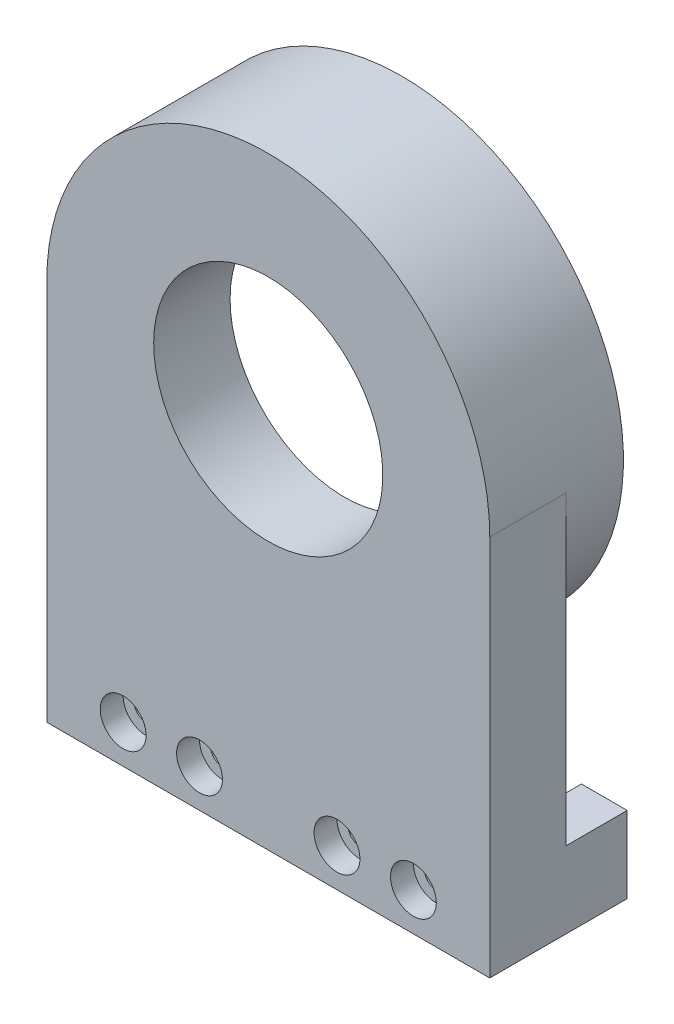
ISO-10303-21;
HEADER;
FILE_DESCRIPTION(('STEP AP214'),'2;1');
FILE_NAME('part.step','',(''),(''),'','','');
FILE_SCHEMA(('AUTOMOTIVE_DESIGN { 1 0 10303 214 1 1 1 1 }'));
ENDSEC;
DATA;
#1=APPLICATION_CONTEXT('core data for automotive mechanical design processes');
#2=APPLICATION_PROTOCOL_DEFINITION('international standard','automotive_design',2000,#1);
#3=PRODUCT_CONTEXT('',#1,'mechanical');
#4=PRODUCT('Part','Part','',(#3));
#5=PRODUCT_RELATED_PRODUCT_CATEGORY('part','',(#4));
#6=PRODUCT_DEFINITION_FORMATION('','',#4);
#7=PRODUCT_DEFINITION_CONTEXT('part definition',#1,'design');
#8=PRODUCT_DEFINITION('design','',#6,#7);
#9=PRODUCT_DEFINITION_SHAPE('','',#8);
#10=(LENGTH_UNIT() NAMED_UNIT(*) SI_UNIT(.MILLI.,.METRE.));
#11=(NAMED_UNIT(*) PLANE_ANGLE_UNIT() SI_UNIT($,.RADIAN.));
#12=(NAMED_UNIT(*) SI_UNIT($,.STERADIAN.) SOLID_ANGLE_UNIT());
#13=UNCERTAINTY_MEASURE_WITH_UNIT(LENGTH_MEASURE(1.E-05),#10,'distance_accuracy_value','');
#14=(GEOMETRIC_REPRESENTATION_CONTEXT(3) GLOBAL_UNCERTAINTY_ASSIGNED_CONTEXT((#13)) GLOBAL_UNIT_ASSIGNED_CONTEXT((#10,
#11,#12)) REPRESENTATION_CONTEXT('',''));
#15=CARTESIAN_POINT('',(0.,0.,0.));
#16=DIRECTION('',(0.,0.,1.));
#17=DIRECTION('',(1.,0.,0.));
#18=AXIS2_PLACEMENT_3D('',#15,#16,#17);
#19=CARTESIAN_POINT('',(-19.,-20.,10.001));
#20=DIRECTION('',(0.,0.,-1.));
#21=DIRECTION('',(-1.,0.,0.));
#22=AXIS2_PLACEMENT_3D('',#19,#20,#21);
#23=CYLINDRICAL_SURFACE('',#22,1.55);
#24=CARTESIAN_POINT('',(-19.,-20.,0.));
#25=DIRECTION('',(0.,0.,-1.));
#26=DIRECTION('',(1.,0.,0.));
#27=AXIS2_PLACEMENT_3D('',#24,#25,#26);
#28=CIRCLE('',#27,1.55);
#29=CARTESIAN_POINT('',(-17.45,-20.,0.));
#30=VERTEX_POINT('',#29);
#31=EDGE_CURVE('E224',#30,#30,#28,.T.);
#32=ORIENTED_EDGE('',*,*,#31,.T.);
#33=EDGE_LOOP('',(#32));
#34=FACE_BOUND('',#33,.T.);
#35=CARTESIAN_POINT('',(-19.,-20.,7.));
#36=DIRECTION('',(0.,0.,1.));
#37=DIRECTION('',(1.,0.,0.));
#38=AXIS2_PLACEMENT_3D('',#35,#36,#37);
#39=CIRCLE('',#38,1.55);
#40=CARTESIAN_POINT('',(-17.45,-20.,7.));
#41=VERTEX_POINT('',#40);
#42=EDGE_CURVE('E47',#41,#41,#39,.F.);
#43=ORIENTED_EDGE('',*,*,#42,.F.);
#44=EDGE_LOOP('',(#43));
#45=FACE_BOUND('',#44,.T.);
#46=ADVANCED_FACE('F43',(#34,#45),#23,.F.);
#47=CARTESIAN_POINT('',(-9.,-20.,10.001));
#48=DIRECTION('',(0.,0.,-1.));
#49=DIRECTION('',(-1.,0.,0.));
#50=AXIS2_PLACEMENT_3D('',#47,#48,#49);
#51=CYLINDRICAL_SURFACE('',#50,1.55);
#52=CARTESIAN_POINT('',(-9.,-20.,0.));
#53=DIRECTION('',(0.,0.,-1.));
#54=DIRECTION('',(1.,0.,0.));
#55=AXIS2_PLACEMENT_3D('',#52,#53,#54);
#56=CIRCLE('',#55,1.55);
#57=CARTESIAN_POINT('',(-7.45,-20.,0.));
#58=VERTEX_POINT('',#57);
#59=EDGE_CURVE('E228',#58,#58,#56,.T.);
#60=ORIENTED_EDGE('',*,*,#59,.T.);
#61=EDGE_LOOP('',(#60));
#62=FACE_BOUND('',#61,.T.);
#63=CARTESIAN_POINT('',(-9.,-20.,7.));
#64=DIRECTION('',(0.,0.,1.));
#65=DIRECTION('',(1.,0.,0.));
#66=AXIS2_PLACEMENT_3D('',#63,#64,#65);
#67=CIRCLE('',#66,1.55);
#68=CARTESIAN_POINT('',(-7.45,-20.,7.));
#69=VERTEX_POINT('',#68);
#70=EDGE_CURVE('E219',#69,#69,#67,.F.);
#71=ORIENTED_EDGE('',*,*,#70,.F.);
#72=EDGE_LOOP('',(#71));
#73=FACE_BOUND('',#72,.T.);
#74=ADVANCED_FACE('F292',(#62,#73),#51,.F.);
#75=CARTESIAN_POINT('',(9.,-20.,10.001));
#76=DIRECTION('',(0.,0.,-1.));
#77=DIRECTION('',(-1.,0.,0.));
#78=AXIS2_PLACEMENT_3D('',#75,#76,#77);
#79=CYLINDRICAL_SURFACE('',#78,1.55);
#80=CARTESIAN_POINT('',(9.,-20.,0.));
#81=DIRECTION('',(0.,0.,-1.));
#82=DIRECTION('',(-1.,0.,0.));
#83=AXIS2_PLACEMENT_3D('',#80,#81,#82);
#84=CIRCLE('',#83,1.55);
#85=CARTESIAN_POINT('',(7.45,-20.,0.));
#86=VERTEX_POINT('',#85);
#87=EDGE_CURVE('E233',#86,#86,#84,.T.);
#88=ORIENTED_EDGE('',*,*,#87,.T.);
#89=EDGE_LOOP('',(#88));
#90=FACE_BOUND('',#89,.T.);
#91=CARTESIAN_POINT('',(9.,-20.,7.));
#92=DIRECTION('',(0.,0.,1.));
#93=DIRECTION('',(1.,0.,0.));
#94=AXIS2_PLACEMENT_3D('',#91,#92,#93);
#95=CIRCLE('',#94,1.55);
#96=CARTESIAN_POINT('',(10.55,-20.,7.));
#97=VERTEX_POINT('',#96);
#98=EDGE_CURVE('E216',#97,#97,#95,.F.);
#99=ORIENTED_EDGE('',*,*,#98,.F.);
#100=EDGE_LOOP('',(#99));
#101=FACE_BOUND('',#100,.T.);
#102=ADVANCED_FACE('F297',(#90,#101),#79,.F.);
#103=CARTESIAN_POINT('',(19.,-20.,10.001));
#104=DIRECTION('',(0.,0.,-1.));
#105=DIRECTION('',(-1.,0.,0.));
#106=AXIS2_PLACEMENT_3D('',#103,#104,#105);
#107=CYLINDRICAL_SURFACE('',#106,1.55);
#108=CARTESIAN_POINT('',(19.,-20.,0.));
#109=DIRECTION('',(0.,0.,-1.));
#110=DIRECTION('',(-1.,0.,0.));
#111=AXIS2_PLACEMENT_3D('',#108,#109,#110);
#112=CIRCLE('',#111,1.55);
#113=CARTESIAN_POINT('',(17.45,-20.,0.));
#114=VERTEX_POINT('',#113);
#115=EDGE_CURVE('E241',#114,#114,#112,.T.);
#116=ORIENTED_EDGE('',*,*,#115,.T.);
#117=EDGE_LOOP('',(#116));
#118=FACE_BOUND('',#117,.T.);
#119=CARTESIAN_POINT('',(19.,-20.,7.));
#120=DIRECTION('',(0.,0.,1.));
#121=DIRECTION('',(1.,0.,0.));
#122=AXIS2_PLACEMENT_3D('',#119,#120,#121);
#123=CIRCLE('',#122,1.55);
#124=CARTESIAN_POINT('',(20.55,-20.,7.));
#125=VERTEX_POINT('',#124);
#126=EDGE_CURVE('E213',#125,#125,#123,.F.);
#127=ORIENTED_EDGE('',*,*,#126,.F.);
#128=EDGE_LOOP('',(#127));
#129=FACE_BOUND('',#128,.T.);
#130=ADVANCED_FACE('F336',(#118,#129),#107,.F.);
#131=CARTESIAN_POINT('',(0.,0.,0.));
#132=DIRECTION('',(0.,0.,1.));
#133=DIRECTION('',(1.,0.,0.));
#134=AXIS2_PLACEMENT_3D('',#131,#132,#133);
#135=PLANE('',#134);
#136=ORIENTED_EDGE('',*,*,#115,.F.);
#137=EDGE_LOOP('',(#136));
#138=FACE_BOUND('',#137,.T.);
#139=ORIENTED_EDGE('',*,*,#87,.F.);
#140=EDGE_LOOP('',(#139));
#141=FACE_BOUND('',#140,.T.);
#142=ORIENTED_EDGE('',*,*,#59,.F.);
#143=EDGE_LOOP('',(#142));
#144=FACE_BOUND('',#143,.T.);
#145=ORIENTED_EDGE('',*,*,#31,.F.);
#146=EDGE_LOOP('',(#145));
#147=FACE_BOUND('',#146,.T.);
#148=DIRECTION('',(1.,0.,0.));
#149=VECTOR('',#148,1.);
#150=CARTESIAN_POINT('',(0.,-15.,0.));
#151=LINE('',#150,#149);
#152=CARTESIAN_POINT('',(-29.,-15.,0.));
#153=VERTEX_POINT('',#152);
#154=CARTESIAN_POINT('',(-23.,-15.,0.));
#155=VERTEX_POINT('',#154);
#156=EDGE_CURVE('E239',#153,#155,#151,.T.);
#157=ORIENTED_EDGE('',*,*,#156,.F.);
#158=DIRECTION('',(0.,-1.,0.));
#159=VECTOR('',#158,1.);
#160=CARTESIAN_POINT('',(-29.,0.,0.));
#161=LINE('',#160,#159);
#162=CARTESIAN_POINT('',(-29.,25.,0.));
#163=VERTEX_POINT('',#162);
#164=EDGE_CURVE('E148',#163,#153,#161,.T.);
#165=ORIENTED_EDGE('',*,*,#164,.F.);
#166=CARTESIAN_POINT('',(0.,25.,0.));
#167=DIRECTION('',(0.,0.,-1.));
#168=DIRECTION('',(-1.,0.,0.));
#169=AXIS2_PLACEMENT_3D('',#166,#167,#168);
#170=CIRCLE('',#169,29.);
#171=CARTESIAN_POINT('',(29.,25.,0.));
#172=VERTEX_POINT('',#171);
#173=EDGE_CURVE('E52',#172,#163,#170,.T.);
#174=ORIENTED_EDGE('',*,*,#173,.F.);
#175=DIRECTION('',(0.,-1.,0.));
#176=VECTOR('',#175,1.);
#177=CARTESIAN_POINT('',(29.,0.,0.));
#178=LINE('',#177,#176);
#179=CARTESIAN_POINT('',(29.,-15.,0.));
#180=VERTEX_POINT('',#179);
#181=EDGE_CURVE('E193',#172,#180,#178,.T.);
#182=ORIENTED_EDGE('',*,*,#181,.T.);
#183=DIRECTION('',(-1.,0.,0.));
#184=VECTOR('',#183,1.);
#185=CARTESIAN_POINT('',(0.,-15.,0.));
#186=LINE('',#185,#184);
#187=CARTESIAN_POINT('',(23.,-15.,0.));
#188=VERTEX_POINT('',#187);
#189=EDGE_CURVE('E150',#180,#188,#186,.T.);
#190=ORIENTED_EDGE('',*,*,#189,.T.);
#191=DIRECTION('',(0.,1.,0.));
#192=VECTOR('',#191,1.);
#193=CARTESIAN_POINT('',(23.,0.,0.));
#194=LINE('',#193,#192);
#195=CARTESIAN_POINT('',(23.,-25.,0.));
#196=VERTEX_POINT('',#195);
#197=EDGE_CURVE('E68',#196,#188,#194,.T.);
#198=ORIENTED_EDGE('',*,*,#197,.F.);
#199=DIRECTION('',(1.,0.,0.));
#200=VECTOR('',#199,1.);
#201=CARTESIAN_POINT('',(0.,-25.,0.));
#202=LINE('',#201,#200);
#203=CARTESIAN_POINT('',(-23.,-25.,0.));
#204=VERTEX_POINT('',#203);
#205=EDGE_CURVE('E202',#204,#196,#202,.T.);
#206=ORIENTED_EDGE('',*,*,#205,.F.);
#207=DIRECTION('',(0.,1.,0.));
#208=VECTOR('',#207,1.);
#209=CARTESIAN_POINT('',(-23.,0.,0.));
#210=LINE('',#209,#208);
#211=EDGE_CURVE('E60',#204,#155,#210,.T.);
#212=ORIENTED_EDGE('',*,*,#211,.T.);
#213=EDGE_LOOP('',(#157,#165,#174,#182,#190,#198,#206,#212));
#214=FACE_BOUND('',#213,.T.);
#215=ADVANCED_FACE('F247',(#138,#141,#144,#147,#214),#135,.F.);
#216=CARTESIAN_POINT('',(0.,25.,10.));
#217=DIRECTION('',(0.,0.,-1.));
#218=DIRECTION('',(-1.,0.,0.));
#219=AXIS2_PLACEMENT_3D('',#216,#217,#218);
#220=CYLINDRICAL_SURFACE('',#219,29.);
#221=DIRECTION('',(0.,0.,-1.));
#222=VECTOR('',#221,1.);
#223=CARTESIAN_POINT('',(29.,25.,10.));
#224=LINE('',#223,#222);
#225=CARTESIAN_POINT('',(29.,25.,10.));
#226=VERTEX_POINT('',#225);
#227=EDGE_CURVE('E200',#226,#172,#224,.T.);
#228=ORIENTED_EDGE('',*,*,#227,.T.);
#229=ORIENTED_EDGE('',*,*,#173,.T.);
#230=DIRECTION('',(0.,0.,-1.));
#231=VECTOR('',#230,1.);
#232=CARTESIAN_POINT('',(-29.,25.,10.));
#233=LINE('',#232,#231);
#234=CARTESIAN_POINT('',(-29.,25.,10.));
#235=VERTEX_POINT('',#234);
#236=EDGE_CURVE('E188',#235,#163,#233,.T.);
#237=ORIENTED_EDGE('',*,*,#236,.F.);
#238=CARTESIAN_POINT('',(0.,25.,10.));
#239=DIRECTION('',(0.,0.,1.));
#240=DIRECTION('',(1.,0.,0.));
#241=AXIS2_PLACEMENT_3D('',#238,#239,#240);
#242=CIRCLE('',#241,29.);
#243=EDGE_CURVE('E189',#235,#226,#242,.F.);
#244=ORIENTED_EDGE('',*,*,#243,.T.);
#245=EDGE_LOOP('',(#228,#229,#237,#244));
#246=FACE_BOUND('',#245,.T.);
#247=CARTESIAN_POINT('',(0.,25.,-7.5));
#248=DIRECTION('',(0.,0.,-1.));
#249=DIRECTION('',(-1.,0.,0.));
#250=AXIS2_PLACEMENT_3D('',#247,#248,#249);
#251=CIRCLE('',#250,29.);
#252=CARTESIAN_POINT('',(-29.,25.,-7.5));
#253=VERTEX_POINT('',#252);
#254=EDGE_CURVE('E183',#253,#253,#251,.T.);
#255=ORIENTED_EDGE('',*,*,#254,.F.);
#256=EDGE_LOOP('',(#255));
#257=FACE_BOUND('',#256,.T.);
#258=ADVANCED_FACE('F45',(#246,#257),#220,.T.);
#259=CARTESIAN_POINT('',(-29.,0.,10.));
#260=DIRECTION('',(1.,0.,0.));
#261=DIRECTION('',(0.,1.,0.));
#262=AXIS2_PLACEMENT_3D('',#259,#260,#261);
#263=PLANE('',#262);
#264=ORIENTED_EDGE('',*,*,#164,.T.);
#265=DIRECTION('',(0.,0.,1.));
#266=VECTOR('',#265,1.);
#267=CARTESIAN_POINT('',(-29.,-15.,-8.));
#268=LINE('',#267,#266);
#269=CARTESIAN_POINT('',(-29.,-15.,-8.));
#270=VERTEX_POINT('',#269);
#271=EDGE_CURVE('E128',#270,#153,#268,.T.);
#272=ORIENTED_EDGE('',*,*,#271,.F.);
#273=DIRECTION('',(0.,1.,0.));
#274=VECTOR('',#273,1.);
#275=CARTESIAN_POINT('',(-29.,0.,-8.));
#276=LINE('',#275,#274);
#277=CARTESIAN_POINT('',(-29.,-25.,-8.));
#278=VERTEX_POINT('',#277);
#279=EDGE_CURVE('E135',#278,#270,#276,.T.);
#280=ORIENTED_EDGE('',*,*,#279,.F.);
#281=DIRECTION('',(0.,0.,-1.));
#282=VECTOR('',#281,1.);
#283=CARTESIAN_POINT('',(-29.,-25.,10.));
#284=LINE('',#283,#282);
#285=CARTESIAN_POINT('',(-29.,-25.,10.));
#286=VERTEX_POINT('',#285);
#287=EDGE_CURVE('E210',#286,#278,#284,.T.);
#288=ORIENTED_EDGE('',*,*,#287,.F.);
#289=DIRECTION('',(0.,-1.,0.));
#290=VECTOR('',#289,1.);
#291=CARTESIAN_POINT('',(-29.,0.,10.));
#292=LINE('',#291,#290);
#293=EDGE_CURVE('E192',#235,#286,#292,.T.);
#294=ORIENTED_EDGE('',*,*,#293,.F.);
#295=ORIENTED_EDGE('',*,*,#236,.T.);
#296=EDGE_LOOP('',(#264,#272,#280,#288,#294,#295));
#297=FACE_BOUND('',#296,.T.);
#298=ADVANCED_FACE('F146',(#297),#263,.F.);
#299=CARTESIAN_POINT('',(0.,-25.,10.));
#300=DIRECTION('',(0.,1.,0.));
#301=DIRECTION('',(0.,0.,1.));
#302=AXIS2_PLACEMENT_3D('',#299,#300,#301);
#303=PLANE('',#302);
#304=ORIENTED_EDGE('',*,*,#287,.T.);
#305=DIRECTION('',(-1.,0.,0.));
#306=VECTOR('',#305,1.);
#307=CARTESIAN_POINT('',(0.,-25.,-8.));
#308=LINE('',#307,#306);
#309=CARTESIAN_POINT('',(-23.,-25.,-8.));
#310=VERTEX_POINT('',#309);
#311=EDGE_CURVE('E141',#310,#278,#308,.T.);
#312=ORIENTED_EDGE('',*,*,#311,.F.);
#313=DIRECTION('',(0.,0.,1.));
#314=VECTOR('',#313,1.);
#315=CARTESIAN_POINT('',(-23.,-25.,-8.));
#316=LINE('',#315,#314);
#317=EDGE_CURVE('E152',#310,#204,#316,.T.);
#318=ORIENTED_EDGE('',*,*,#317,.T.);
#319=ORIENTED_EDGE('',*,*,#205,.T.);
#320=DIRECTION('',(0.,0.,1.));
#321=VECTOR('',#320,1.);
#322=CARTESIAN_POINT('',(23.,-25.,-8.));
#323=LINE('',#322,#321);
#324=CARTESIAN_POINT('',(23.,-25.,-8.));
#325=VERTEX_POINT('',#324);
#326=EDGE_CURVE('E172',#325,#196,#323,.T.);
#327=ORIENTED_EDGE('',*,*,#326,.F.);
#328=DIRECTION('',(-1.,0.,0.));
#329=VECTOR('',#328,1.);
#330=CARTESIAN_POINT('',(0.,-25.,-8.));
#331=LINE('',#330,#329);
#332=CARTESIAN_POINT('',(29.,-25.,-8.));
#333=VERTEX_POINT('',#332);
#334=EDGE_CURVE('E159',#333,#325,#331,.T.);
#335=ORIENTED_EDGE('',*,*,#334,.F.);
#336=DIRECTION('',(0.,0.,-1.));
#337=VECTOR('',#336,1.);
#338=CARTESIAN_POINT('',(29.,-25.,10.));
#339=LINE('',#338,#337);
#340=CARTESIAN_POINT('',(29.,-25.,10.));
#341=VERTEX_POINT('',#340);
#342=EDGE_CURVE('E208',#341,#333,#339,.T.);
#343=ORIENTED_EDGE('',*,*,#342,.F.);
#344=DIRECTION('',(1.,0.,0.));
#345=VECTOR('',#344,1.);
#346=CARTESIAN_POINT('',(0.,-25.,10.));
#347=LINE('',#346,#345);
#348=EDGE_CURVE('E195',#286,#341,#347,.T.);
#349=ORIENTED_EDGE('',*,*,#348,.F.);
#350=EDGE_LOOP('',(#304,#312,#318,#319,#327,#335,#343,#349));
#351=FACE_BOUND('',#350,.T.);
#352=ADVANCED_FACE('F244',(#351),#303,.F.);
#353=CARTESIAN_POINT('',(29.,0.,10.));
#354=DIRECTION('',(1.,0.,0.));
#355=DIRECTION('',(0.,0.,-1.));
#356=AXIS2_PLACEMENT_3D('',#353,#354,#355);
#357=PLANE('',#356);
#358=ORIENTED_EDGE('',*,*,#181,.F.);
#359=ORIENTED_EDGE('',*,*,#227,.F.);
#360=DIRECTION('',(0.,-1.,0.));
#361=VECTOR('',#360,1.);
#362=CARTESIAN_POINT('',(29.,0.,10.));
#363=LINE('',#362,#361);
#364=EDGE_CURVE('E197',#226,#341,#363,.T.);
#365=ORIENTED_EDGE('',*,*,#364,.T.);
#366=ORIENTED_EDGE('',*,*,#342,.T.);
#367=DIRECTION('',(0.,-1.,0.));
#368=VECTOR('',#367,1.);
#369=CARTESIAN_POINT('',(29.,0.,-8.));
#370=LINE('',#369,#368);
#371=CARTESIAN_POINT('',(29.,-15.,-8.));
#372=VERTEX_POINT('',#371);
#373=EDGE_CURVE('E156',#372,#333,#370,.T.);
#374=ORIENTED_EDGE('',*,*,#373,.F.);
#375=DIRECTION('',(0.,0.,1.));
#376=VECTOR('',#375,1.);
#377=CARTESIAN_POINT('',(29.,-15.,-8.));
#378=LINE('',#377,#376);
#379=EDGE_CURVE('E165',#372,#180,#378,.T.);
#380=ORIENTED_EDGE('',*,*,#379,.T.);
#381=EDGE_LOOP('',(#358,#359,#365,#366,#374,#380));
#382=FACE_BOUND('',#381,.T.);
#383=ADVANCED_FACE('F263',(#382),#357,.T.);
#384=CARTESIAN_POINT('',(0.,0.,10.));
#385=DIRECTION('',(0.,0.,1.));
#386=DIRECTION('',(1.,0.,0.));
#387=AXIS2_PLACEMENT_3D('',#384,#385,#386);
#388=PLANE('',#387);
#389=CARTESIAN_POINT('',(0.,25.,10.));
#390=DIRECTION('',(0.,0.,-1.));
#391=DIRECTION('',(-1.,0.,0.));
#392=AXIS2_PLACEMENT_3D('',#389,#390,#391);
#393=CIRCLE('',#392,15.);
#394=CARTESIAN_POINT('',(-15.,25.,10.));
#395=VERTEX_POINT('',#394);
#396=EDGE_CURVE('E359',#395,#395,#393,.T.);
#397=ORIENTED_EDGE('',*,*,#396,.T.);
#398=EDGE_LOOP('',(#397));
#399=FACE_BOUND('',#398,.T.);
#400=CARTESIAN_POINT('',(19.,-20.,10.));
#401=DIRECTION('',(0.,0.,1.));
#402=DIRECTION('',(1.,0.,0.));
#403=AXIS2_PLACEMENT_3D('',#400,#401,#402);
#404=CIRCLE('',#403,3.);
#405=CARTESIAN_POINT('',(22.,-20.,10.));
#406=VERTEX_POINT('',#405);
#407=EDGE_CURVE('E374',#406,#406,#404,.T.);
#408=ORIENTED_EDGE('',*,*,#407,.F.);
#409=EDGE_LOOP('',(#408));
#410=FACE_BOUND('',#409,.T.);
#411=CARTESIAN_POINT('',(9.,-20.,10.));
#412=DIRECTION('',(0.,0.,1.));
#413=DIRECTION('',(1.,0.,0.));
#414=AXIS2_PLACEMENT_3D('',#411,#412,#413);
#415=CIRCLE('',#414,3.);
#416=CARTESIAN_POINT('',(12.,-20.,10.));
#417=VERTEX_POINT('',#416);
#418=EDGE_CURVE('E371',#417,#417,#415,.T.);
#419=ORIENTED_EDGE('',*,*,#418,.F.);
#420=EDGE_LOOP('',(#419));
#421=FACE_BOUND('',#420,.T.);
#422=CARTESIAN_POINT('',(-9.,-20.,10.));
#423=DIRECTION('',(0.,0.,1.));
#424=DIRECTION('',(1.,0.,0.));
#425=AXIS2_PLACEMENT_3D('',#422,#423,#424);
#426=CIRCLE('',#425,3.);
#427=CARTESIAN_POINT('',(-6.,-20.,10.));
#428=VERTEX_POINT('',#427);
#429=EDGE_CURVE('E365',#428,#428,#426,.T.);
#430=ORIENTED_EDGE('',*,*,#429,.F.);
#431=EDGE_LOOP('',(#430));
#432=FACE_BOUND('',#431,.T.);
#433=CARTESIAN_POINT('',(-19.,-20.,10.));
#434=DIRECTION('',(0.,0.,1.));
#435=DIRECTION('',(1.,0.,0.));
#436=AXIS2_PLACEMENT_3D('',#433,#434,#435);
#437=CIRCLE('',#436,3.);
#438=CARTESIAN_POINT('',(-16.,-20.,10.));
#439=VERTEX_POINT('',#438);
#440=EDGE_CURVE('E358',#439,#439,#437,.T.);
#441=ORIENTED_EDGE('',*,*,#440,.F.);
#442=EDGE_LOOP('',(#441));
#443=FACE_BOUND('',#442,.T.);
#444=ORIENTED_EDGE('',*,*,#243,.F.);
#445=ORIENTED_EDGE('',*,*,#293,.T.);
#446=ORIENTED_EDGE('',*,*,#348,.T.);
#447=ORIENTED_EDGE('',*,*,#364,.F.);
#448=EDGE_LOOP('',(#444,#445,#446,#447));
#449=FACE_BOUND('',#448,.T.);
#450=ADVANCED_FACE('F266',(#399,#410,#421,#432,#443,#449),#388,.T.);
#451=CARTESIAN_POINT('',(0.,25.,-7.5));
#452=DIRECTION('',(0.,0.,-1.));
#453=DIRECTION('',(-1.,0.,0.));
#454=AXIS2_PLACEMENT_3D('',#451,#452,#453);
#455=PLANE('',#454);
#456=ORIENTED_EDGE('',*,*,#254,.T.);
#457=EDGE_LOOP('',(#456));
#458=FACE_BOUND('',#457,.T.);
#459=CARTESIAN_POINT('',(0.,25.,-7.5));
#460=DIRECTION('',(0.,0.,-1.));
#461=DIRECTION('',(-1.,0.,0.));
#462=AXIS2_PLACEMENT_3D('',#459,#460,#461);
#463=CIRCLE('',#462,26.1);
#464=CARTESIAN_POINT('',(-26.1,25.,-7.5));
#465=VERTEX_POINT('',#464);
#466=EDGE_CURVE('E178',#465,#465,#463,.T.);
#467=ORIENTED_EDGE('',*,*,#466,.F.);
#468=EDGE_LOOP('',(#467));
#469=FACE_BOUND('',#468,.T.);
#470=ADVANCED_FACE('F273',(#458,#469),#455,.T.);
#471=CARTESIAN_POINT('',(0.,25.,-7.5));
#472=DIRECTION('',(0.,0.,1.));
#473=DIRECTION('',(1.,0.,0.));
#474=AXIS2_PLACEMENT_3D('',#471,#472,#473);
#475=CYLINDRICAL_SURFACE('',#474,26.1);
#476=CARTESIAN_POINT('',(0.,25.,-0.5));
#477=DIRECTION('',(0.,0.,-1.));
#478=DIRECTION('',(-1.,0.,0.));
#479=AXIS2_PLACEMENT_3D('',#476,#477,#478);
#480=CIRCLE('',#479,26.1);
#481=CARTESIAN_POINT('',(-26.1,25.,-0.5));
#482=VERTEX_POINT('',#481);
#483=EDGE_CURVE('E12',#482,#482,#480,.T.);
#484=ORIENTED_EDGE('',*,*,#483,.F.);
#485=EDGE_LOOP('',(#484));
#486=FACE_BOUND('',#485,.T.);
#487=ORIENTED_EDGE('',*,*,#466,.T.);
#488=EDGE_LOOP('',(#487));
#489=FACE_BOUND('',#488,.T.);
#490=ADVANCED_FACE('F276',(#486,#489),#475,.F.);
#491=CARTESIAN_POINT('',(0.,25.,-0.5));
#492=DIRECTION('',(0.,0.,-1.));
#493=DIRECTION('',(-1.,0.,0.));
#494=AXIS2_PLACEMENT_3D('',#491,#492,#493);
#495=PLANE('',#494);
#496=ORIENTED_EDGE('',*,*,#483,.T.);
#497=EDGE_LOOP('',(#496));
#498=FACE_BOUND('',#497,.T.);
#499=CARTESIAN_POINT('',(0.,25.,-0.5));
#500=DIRECTION('',(0.,0.,-1.));
#501=DIRECTION('',(-1.,0.,0.));
#502=AXIS2_PLACEMENT_3D('',#499,#500,#501);
#503=CIRCLE('',#502,24.);
#504=CARTESIAN_POINT('',(-24.,25.,-0.5));
#505=VERTEX_POINT('',#504);
#506=EDGE_CURVE('E175',#505,#505,#503,.T.);
#507=ORIENTED_EDGE('',*,*,#506,.F.);
#508=EDGE_LOOP('',(#507));
#509=FACE_BOUND('',#508,.T.);
#510=ADVANCED_FACE('F281',(#498,#509),#495,.T.);
#511=CARTESIAN_POINT('',(0.,25.,-0.5));
#512=DIRECTION('',(0.,0.,1.));
#513=DIRECTION('',(1.,0.,0.));
#514=AXIS2_PLACEMENT_3D('',#511,#512,#513);
#515=CYLINDRICAL_SURFACE('',#514,24.);
#516=ORIENTED_EDGE('',*,*,#506,.T.);
#517=EDGE_LOOP('',(#516));
#518=FACE_BOUND('',#517,.T.);
#519=CARTESIAN_POINT('',(0.,25.,0.));
#520=DIRECTION('',(0.,0.,-1.));
#521=DIRECTION('',(-1.,0.,0.));
#522=AXIS2_PLACEMENT_3D('',#519,#520,#521);
#523=CIRCLE('',#522,24.);
#524=CARTESIAN_POINT('',(-24.,25.,0.));
#525=VERTEX_POINT('',#524);
#526=EDGE_CURVE('E174',#525,#525,#523,.T.);
#527=ORIENTED_EDGE('',*,*,#526,.F.);
#528=EDGE_LOOP('',(#527));
#529=FACE_BOUND('',#528,.T.);
#530=ADVANCED_FACE('F287',(#518,#529),#515,.F.);
#531=CARTESIAN_POINT('',(0.,25.,0.));
#532=DIRECTION('',(0.,0.,-1.));
#533=DIRECTION('',(-1.,0.,0.));
#534=AXIS2_PLACEMENT_3D('',#531,#532,#533);
#535=CIRCLE('',#534,15.);
#536=CARTESIAN_POINT('',(-15.,25.,0.));
#537=VERTEX_POINT('',#536);
#538=EDGE_CURVE('E379',#537,#537,#535,.T.);
#539=ORIENTED_EDGE('',*,*,#538,.F.);
#540=EDGE_LOOP('',(#539));
#541=FACE_BOUND('',#540,.T.);
#542=ORIENTED_EDGE('',*,*,#526,.T.);
#543=EDGE_LOOP('',(#542));
#544=FACE_BOUND('',#543,.T.);
#545=ADVANCED_FACE('F317',(#541,#544),#135,.F.);
#546=CARTESIAN_POINT('',(23.,0.,-8.));
#547=DIRECTION('',(1.,0.,0.));
#548=DIRECTION('',(0.,0.,-1.));
#549=AXIS2_PLACEMENT_3D('',#546,#547,#548);
#550=PLANE('',#549);
#551=ORIENTED_EDGE('',*,*,#197,.T.);
#552=DIRECTION('',(0.,0.,1.));
#553=VECTOR('',#552,1.);
#554=CARTESIAN_POINT('',(23.,-15.,-8.));
#555=LINE('',#554,#553);
#556=CARTESIAN_POINT('',(23.,-15.,-8.));
#557=VERTEX_POINT('',#556);
#558=EDGE_CURVE('E170',#557,#188,#555,.T.);
#559=ORIENTED_EDGE('',*,*,#558,.F.);
#560=DIRECTION('',(0.,1.,0.));
#561=VECTOR('',#560,1.);
#562=CARTESIAN_POINT('',(23.,0.,-8.));
#563=LINE('',#562,#561);
#564=EDGE_CURVE('E161',#325,#557,#563,.T.);
#565=ORIENTED_EDGE('',*,*,#564,.F.);
#566=ORIENTED_EDGE('',*,*,#326,.T.);
#567=EDGE_LOOP('',(#551,#559,#565,#566));
#568=FACE_BOUND('',#567,.T.);
#569=ADVANCED_FACE('F255',(#568),#550,.F.);
#570=CARTESIAN_POINT('',(0.,-15.,-8.));
#571=DIRECTION('',(0.,1.,0.));
#572=DIRECTION('',(0.,0.,1.));
#573=AXIS2_PLACEMENT_3D('',#570,#571,#572);
#574=PLANE('',#573);
#575=ORIENTED_EDGE('',*,*,#189,.F.);
#576=ORIENTED_EDGE('',*,*,#379,.F.);
#577=DIRECTION('',(-1.,0.,0.));
#578=VECTOR('',#577,1.);
#579=CARTESIAN_POINT('',(0.,-15.,-8.));
#580=LINE('',#579,#578);
#581=EDGE_CURVE('E163',#372,#557,#580,.T.);
#582=ORIENTED_EDGE('',*,*,#581,.T.);
#583=ORIENTED_EDGE('',*,*,#558,.T.);
#584=EDGE_LOOP('',(#575,#576,#582,#583));
#585=FACE_BOUND('',#584,.T.);
#586=ADVANCED_FACE('F251',(#585),#574,.T.);
#587=CARTESIAN_POINT('',(0.,0.,-8.));
#588=DIRECTION('',(0.,0.,-1.));
#589=DIRECTION('',(-1.,0.,0.));
#590=AXIS2_PLACEMENT_3D('',#587,#588,#589);
#591=PLANE('',#590);
#592=ORIENTED_EDGE('',*,*,#373,.T.);
#593=ORIENTED_EDGE('',*,*,#334,.T.);
#594=ORIENTED_EDGE('',*,*,#564,.T.);
#595=ORIENTED_EDGE('',*,*,#581,.F.);
#596=EDGE_LOOP('',(#592,#593,#594,#595));
#597=FACE_BOUND('',#596,.T.);
#598=ADVANCED_FACE('F257',(#597),#591,.T.);
#599=CARTESIAN_POINT('',(0.,-15.,-8.));
#600=DIRECTION('',(0.,-1.,0.));
#601=DIRECTION('',(0.,0.,-1.));
#602=AXIS2_PLACEMENT_3D('',#599,#600,#601);
#603=PLANE('',#602);
#604=ORIENTED_EDGE('',*,*,#156,.T.);
#605=DIRECTION('',(0.,0.,1.));
#606=VECTOR('',#605,1.);
#607=CARTESIAN_POINT('',(-23.,-15.,-8.));
#608=LINE('',#607,#606);
#609=CARTESIAN_POINT('',(-23.,-15.,-8.));
#610=VERTEX_POINT('',#609);
#611=EDGE_CURVE('E130',#610,#155,#608,.T.);
#612=ORIENTED_EDGE('',*,*,#611,.F.);
#613=DIRECTION('',(1.,0.,0.));
#614=VECTOR('',#613,1.);
#615=CARTESIAN_POINT('',(0.,-15.,-8.));
#616=LINE('',#615,#614);
#617=EDGE_CURVE('E123',#270,#610,#616,.T.);
#618=ORIENTED_EDGE('',*,*,#617,.F.);
#619=ORIENTED_EDGE('',*,*,#271,.T.);
#620=EDGE_LOOP('',(#604,#612,#618,#619));
#621=FACE_BOUND('',#620,.T.);
#622=ADVANCED_FACE('F126',(#621),#603,.F.);
#623=CARTESIAN_POINT('',(-23.,0.,-8.));
#624=DIRECTION('',(1.,0.,0.));
#625=DIRECTION('',(0.,1.,0.));
#626=AXIS2_PLACEMENT_3D('',#623,#624,#625);
#627=PLANE('',#626);
#628=ORIENTED_EDGE('',*,*,#211,.F.);
#629=ORIENTED_EDGE('',*,*,#317,.F.);
#630=DIRECTION('',(0.,1.,0.));
#631=VECTOR('',#630,1.);
#632=CARTESIAN_POINT('',(-23.,0.,-8.));
#633=LINE('',#632,#631);
#634=EDGE_CURVE('E134',#310,#610,#633,.T.);
#635=ORIENTED_EDGE('',*,*,#634,.T.);
#636=ORIENTED_EDGE('',*,*,#611,.T.);
#637=EDGE_LOOP('',(#628,#629,#635,#636));
#638=FACE_BOUND('',#637,.T.);
#639=ADVANCED_FACE('F306',(#638),#627,.T.);
#640=CARTESIAN_POINT('',(0.,0.,-8.));
#641=DIRECTION('',(0.,0.,-1.));
#642=DIRECTION('',(-1.,0.,0.));
#643=AXIS2_PLACEMENT_3D('',#640,#641,#642);
#644=PLANE('',#643);
#645=ORIENTED_EDGE('',*,*,#279,.T.);
#646=ORIENTED_EDGE('',*,*,#617,.T.);
#647=ORIENTED_EDGE('',*,*,#634,.F.);
#648=ORIENTED_EDGE('',*,*,#311,.T.);
#649=EDGE_LOOP('',(#645,#646,#647,#648));
#650=FACE_BOUND('',#649,.T.);
#651=ADVANCED_FACE('F139',(#650),#644,.T.);
#652=CARTESIAN_POINT('',(19.,-20.,7.));
#653=DIRECTION('',(0.,0.,1.));
#654=DIRECTION('',(1.,0.,0.));
#655=AXIS2_PLACEMENT_3D('',#652,#653,#654);
#656=PLANE('',#655);
#657=CARTESIAN_POINT('',(19.,-20.,7.));
#658=DIRECTION('',(0.,0.,1.));
#659=DIRECTION('',(1.,0.,0.));
#660=AXIS2_PLACEMENT_3D('',#657,#658,#659);
#661=CIRCLE('',#660,3.);
#662=CARTESIAN_POINT('',(22.,-20.,7.));
#663=VERTEX_POINT('',#662);
#664=EDGE_CURVE('E217',#663,#663,#661,.T.);
#665=ORIENTED_EDGE('',*,*,#664,.T.);
#666=EDGE_LOOP('',(#665));
#667=FACE_BOUND('',#666,.T.);
#668=ORIENTED_EDGE('',*,*,#126,.T.);
#669=EDGE_LOOP('',(#668));
#670=FACE_BOUND('',#669,.T.);
#671=ADVANCED_FACE('F305',(#667,#670),#656,.T.);
#672=CARTESIAN_POINT('',(19.,-20.,7.));
#673=DIRECTION('',(0.,0.,1.));
#674=DIRECTION('',(1.,0.,0.));
#675=AXIS2_PLACEMENT_3D('',#672,#673,#674);
#676=CYLINDRICAL_SURFACE('',#675,3.);
#677=ORIENTED_EDGE('',*,*,#664,.F.);
#678=EDGE_LOOP('',(#677));
#679=FACE_BOUND('',#678,.T.);
#680=ORIENTED_EDGE('',*,*,#407,.T.);
#681=EDGE_LOOP('',(#680));
#682=FACE_BOUND('',#681,.T.);
#683=ADVANCED_FACE('F401',(#679,#682),#676,.F.);
#684=CARTESIAN_POINT('',(9.,-20.,7.));
#685=DIRECTION('',(0.,0.,1.));
#686=DIRECTION('',(1.,0.,0.));
#687=AXIS2_PLACEMENT_3D('',#684,#685,#686);
#688=PLANE('',#687);
#689=CARTESIAN_POINT('',(9.,-20.,7.));
#690=DIRECTION('',(0.,0.,1.));
#691=DIRECTION('',(1.,0.,0.));
#692=AXIS2_PLACEMENT_3D('',#689,#690,#691);
#693=CIRCLE('',#692,3.);
#694=CARTESIAN_POINT('',(12.,-20.,7.));
#695=VERTEX_POINT('',#694);
#696=EDGE_CURVE('E368',#695,#695,#693,.T.);
#697=ORIENTED_EDGE('',*,*,#696,.T.);
#698=EDGE_LOOP('',(#697));
#699=FACE_BOUND('',#698,.T.);
#700=ORIENTED_EDGE('',*,*,#98,.T.);
#701=EDGE_LOOP('',(#700));
#702=FACE_BOUND('',#701,.T.);
#703=ADVANCED_FACE('F405',(#699,#702),#688,.T.);
#704=CARTESIAN_POINT('',(9.,-20.,7.));
#705=DIRECTION('',(0.,0.,1.));
#706=DIRECTION('',(1.,0.,0.));
#707=AXIS2_PLACEMENT_3D('',#704,#705,#706);
#708=CYLINDRICAL_SURFACE('',#707,3.);
#709=ORIENTED_EDGE('',*,*,#696,.F.);
#710=EDGE_LOOP('',(#709));
#711=FACE_BOUND('',#710,.T.);
#712=ORIENTED_EDGE('',*,*,#418,.T.);
#713=EDGE_LOOP('',(#712));
#714=FACE_BOUND('',#713,.T.);
#715=ADVANCED_FACE('F407',(#711,#714),#708,.F.);
#716=CARTESIAN_POINT('',(-9.,-20.,7.));
#717=DIRECTION('',(0.,0.,1.));
#718=DIRECTION('',(1.,0.,0.));
#719=AXIS2_PLACEMENT_3D('',#716,#717,#718);
#720=PLANE('',#719);
#721=CARTESIAN_POINT('',(-9.,-20.,7.));
#722=DIRECTION('',(0.,0.,1.));
#723=DIRECTION('',(1.,0.,0.));
#724=AXIS2_PLACEMENT_3D('',#721,#722,#723);
#725=CIRCLE('',#724,3.);
#726=CARTESIAN_POINT('',(-6.,-20.,7.));
#727=VERTEX_POINT('',#726);
#728=EDGE_CURVE('E362',#727,#727,#725,.T.);
#729=ORIENTED_EDGE('',*,*,#728,.T.);
#730=EDGE_LOOP('',(#729));
#731=FACE_BOUND('',#730,.T.);
#732=ORIENTED_EDGE('',*,*,#70,.T.);
#733=EDGE_LOOP('',(#732));
#734=FACE_BOUND('',#733,.T.);
#735=ADVANCED_FACE('F410',(#731,#734),#720,.T.);
#736=CARTESIAN_POINT('',(-9.,-20.,7.));
#737=DIRECTION('',(0.,0.,1.));
#738=DIRECTION('',(1.,0.,0.));
#739=AXIS2_PLACEMENT_3D('',#736,#737,#738);
#740=CYLINDRICAL_SURFACE('',#739,3.);
#741=ORIENTED_EDGE('',*,*,#728,.F.);
#742=EDGE_LOOP('',(#741));
#743=FACE_BOUND('',#742,.T.);
#744=ORIENTED_EDGE('',*,*,#429,.T.);
#745=EDGE_LOOP('',(#744));
#746=FACE_BOUND('',#745,.T.);
#747=ADVANCED_FACE('F415',(#743,#746),#740,.F.);
#748=CARTESIAN_POINT('',(-19.,-20.,7.));
#749=DIRECTION('',(0.,0.,1.));
#750=DIRECTION('',(1.,0.,0.));
#751=AXIS2_PLACEMENT_3D('',#748,#749,#750);
#752=PLANE('',#751);
#753=CARTESIAN_POINT('',(-19.,-20.,7.));
#754=DIRECTION('',(0.,0.,1.));
#755=DIRECTION('',(1.,0.,0.));
#756=AXIS2_PLACEMENT_3D('',#753,#754,#755);
#757=CIRCLE('',#756,3.);
#758=CARTESIAN_POINT('',(-16.,-20.,7.));
#759=VERTEX_POINT('',#758);
#760=EDGE_CURVE('E355',#759,#759,#757,.T.);
#761=ORIENTED_EDGE('',*,*,#760,.T.);
#762=EDGE_LOOP('',(#761));
#763=FACE_BOUND('',#762,.T.);
#764=ORIENTED_EDGE('',*,*,#42,.T.);
#765=EDGE_LOOP('',(#764));
#766=FACE_BOUND('',#765,.T.);
#767=ADVANCED_FACE('F395',(#763,#766),#752,.T.);
#768=CARTESIAN_POINT('',(-19.,-20.,7.));
#769=DIRECTION('',(0.,0.,1.));
#770=DIRECTION('',(1.,0.,0.));
#771=AXIS2_PLACEMENT_3D('',#768,#769,#770);
#772=CYLINDRICAL_SURFACE('',#771,3.);
#773=ORIENTED_EDGE('',*,*,#760,.F.);
#774=EDGE_LOOP('',(#773));
#775=FACE_BOUND('',#774,.T.);
#776=ORIENTED_EDGE('',*,*,#440,.T.);
#777=EDGE_LOOP('',(#776));
#778=FACE_BOUND('',#777,.T.);
#779=ADVANCED_FACE('F390',(#775,#778),#772,.F.);
#780=CARTESIAN_POINT('',(0.,25.,10.));
#781=DIRECTION('',(0.,0.,-1.));
#782=DIRECTION('',(-1.,0.,0.));
#783=AXIS2_PLACEMENT_3D('',#780,#781,#782);
#784=CYLINDRICAL_SURFACE('',#783,15.);
#785=ORIENTED_EDGE('',*,*,#396,.F.);
#786=EDGE_LOOP('',(#785));
#787=FACE_BOUND('',#786,.T.);
#788=ORIENTED_EDGE('',*,*,#538,.T.);
#789=EDGE_LOOP('',(#788));
#790=FACE_BOUND('',#789,.T.);
#791=ADVANCED_FACE('F387',(#787,#790),#784,.F.);
#792=CLOSED_SHELL('',(#46,#74,#102,#130,#215,#258,#298,#352,#383,#450,#470,#490,#510,#530,#545,
#569,#586,#598,#622,#639,#651,#671,#683,#703,#715,#735,#747,#767,#779,#791));
#793=MANIFOLD_SOLID_BREP('B2',#792);
#794=ADVANCED_BREP_SHAPE_REPRESENTATION('',(#18,#793),#14);
#795=SHAPE_DEFINITION_REPRESENTATION(#9,#794);
ENDSEC;
END-ISO-10303-21;
